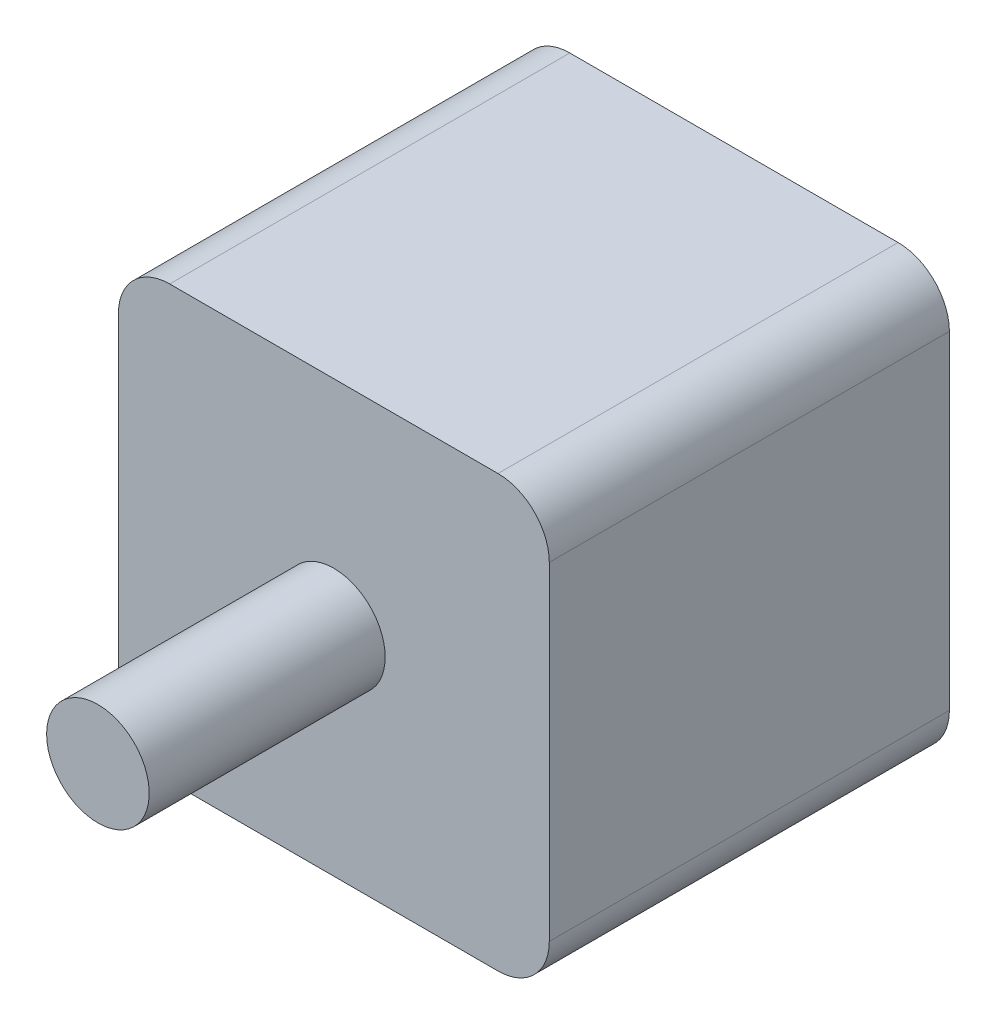
ISO-10303-21;
HEADER;
FILE_DESCRIPTION(('STEP AP214'),'2;1');
FILE_NAME('part.step','',(''),(''),'','','');
FILE_SCHEMA(('AUTOMOTIVE_DESIGN { 1 0 10303 214 1 1 1 1 }'));
ENDSEC;
DATA;
#1=APPLICATION_CONTEXT('core data for automotive mechanical design processes');
#2=APPLICATION_PROTOCOL_DEFINITION('international standard','automotive_design',2000,#1);
#3=PRODUCT_CONTEXT('',#1,'mechanical');
#4=PRODUCT('Part','Part','',(#3));
#5=PRODUCT_RELATED_PRODUCT_CATEGORY('part','',(#4));
#6=PRODUCT_DEFINITION_FORMATION('','',#4);
#7=PRODUCT_DEFINITION_CONTEXT('part definition',#1,'design');
#8=PRODUCT_DEFINITION('design','',#6,#7);
#9=PRODUCT_DEFINITION_SHAPE('','',#8);
#10=(LENGTH_UNIT() NAMED_UNIT(*) SI_UNIT(.MILLI.,.METRE.));
#11=(NAMED_UNIT(*) PLANE_ANGLE_UNIT() SI_UNIT($,.RADIAN.));
#12=(NAMED_UNIT(*) SI_UNIT($,.STERADIAN.) SOLID_ANGLE_UNIT());
#13=UNCERTAINTY_MEASURE_WITH_UNIT(LENGTH_MEASURE(1.E-05),#10,'distance_accuracy_value','');
#14=(GEOMETRIC_REPRESENTATION_CONTEXT(3) GLOBAL_UNCERTAINTY_ASSIGNED_CONTEXT((#13)) GLOBAL_UNIT_ASSIGNED_CONTEXT((#10,
#11,#12)) REPRESENTATION_CONTEXT('',''));
#15=CARTESIAN_POINT('',(0.,0.,0.));
#16=DIRECTION('',(0.,0.,1.));
#17=DIRECTION('',(1.,0.,0.));
#18=AXIS2_PLACEMENT_3D('',#15,#16,#17);
#19=CARTESIAN_POINT('',(0.,0.,0.));
#20=DIRECTION('',(0.,0.,1.));
#21=DIRECTION('',(1.,0.,0.));
#22=AXIS2_PLACEMENT_3D('',#19,#20,#21);
#23=PLANE('',#22);
#24=DIRECTION('',(0.,1.,0.));
#25=VECTOR('',#24,1.);
#26=CARTESIAN_POINT('',(42.,0.,0.));
#27=LINE('',#26,#25);
#28=CARTESIAN_POINT('',(42.,-37.,0.));
#29=VERTEX_POINT('',#28);
#30=CARTESIAN_POINT('',(42.,-5.,0.));
#31=VERTEX_POINT('',#30);
#32=EDGE_CURVE('E117',#29,#31,#27,.T.);
#33=ORIENTED_EDGE('',*,*,#32,.F.);
#34=CARTESIAN_POINT('',(37.,-37.,0.));
#35=DIRECTION('',(0.,0.,1.));
#36=DIRECTION('',(1.,0.,0.));
#37=AXIS2_PLACEMENT_3D('',#34,#35,#36);
#38=CIRCLE('',#37,5.);
#39=CARTESIAN_POINT('',(37.,-42.,0.));
#40=VERTEX_POINT('',#39);
#41=EDGE_CURVE('E100',#29,#40,#38,.F.);
#42=ORIENTED_EDGE('',*,*,#41,.T.);
#43=DIRECTION('',(1.,0.,0.));
#44=VECTOR('',#43,1.);
#45=CARTESIAN_POINT('',(0.,-42.,0.));
#46=LINE('',#45,#44);
#47=CARTESIAN_POINT('',(5.,-42.,0.));
#48=VERTEX_POINT('',#47);
#49=EDGE_CURVE('E125',#48,#40,#46,.T.);
#50=ORIENTED_EDGE('',*,*,#49,.F.);
#51=CARTESIAN_POINT('',(5.,-37.,0.));
#52=DIRECTION('',(0.,0.,1.));
#53=DIRECTION('',(1.,0.,0.));
#54=AXIS2_PLACEMENT_3D('',#51,#52,#53);
#55=CIRCLE('',#54,5.);
#56=CARTESIAN_POINT('',(0.,-37.,0.));
#57=VERTEX_POINT('',#56);
#58=EDGE_CURVE('E111',#48,#57,#55,.F.);
#59=ORIENTED_EDGE('',*,*,#58,.T.);
#60=DIRECTION('',(0.,-1.,0.));
#61=VECTOR('',#60,1.);
#62=CARTESIAN_POINT('',(0.,0.,0.));
#63=LINE('',#62,#61);
#64=CARTESIAN_POINT('',(0.,-5.,0.));
#65=VERTEX_POINT('',#64);
#66=EDGE_CURVE('E129',#65,#57,#63,.T.);
#67=ORIENTED_EDGE('',*,*,#66,.F.);
#68=CARTESIAN_POINT('',(5.,-5.,0.));
#69=DIRECTION('',(0.,0.,1.));
#70=DIRECTION('',(1.,0.,0.));
#71=AXIS2_PLACEMENT_3D('',#68,#69,#70);
#72=CIRCLE('',#71,5.);
#73=CARTESIAN_POINT('',(5.,0.,0.));
#74=VERTEX_POINT('',#73);
#75=EDGE_CURVE('E136',#65,#74,#72,.F.);
#76=ORIENTED_EDGE('',*,*,#75,.T.);
#77=DIRECTION('',(-1.,0.,0.));
#78=VECTOR('',#77,1.);
#79=CARTESIAN_POINT('',(0.,0.,0.));
#80=LINE('',#79,#78);
#81=CARTESIAN_POINT('',(37.,0.,0.));
#82=VERTEX_POINT('',#81);
#83=EDGE_CURVE('E124',#82,#74,#80,.T.);
#84=ORIENTED_EDGE('',*,*,#83,.F.);
#85=CARTESIAN_POINT('',(37.,-5.,0.));
#86=DIRECTION('',(0.,0.,1.));
#87=DIRECTION('',(1.,0.,0.));
#88=AXIS2_PLACEMENT_3D('',#85,#86,#87);
#89=CIRCLE('',#88,5.);
#90=EDGE_CURVE('E120',#82,#31,#89,.F.);
#91=ORIENTED_EDGE('',*,*,#90,.T.);
#92=EDGE_LOOP('',(#33,#42,#50,#59,#67,#76,#84,#91));
#93=FACE_BOUND('',#92,.T.);
#94=ADVANCED_FACE('F33',(#93),#23,.F.);
#95=CARTESIAN_POINT('',(0.,0.,39.));
#96=DIRECTION('',(1.,0.,0.));
#97=DIRECTION('',(0.,1.,0.));
#98=AXIS2_PLACEMENT_3D('',#95,#96,#97);
#99=PLANE('',#98);
#100=ORIENTED_EDGE('',*,*,#66,.T.);
#101=DIRECTION('',(0.,0.,-1.));
#102=VECTOR('',#101,1.);
#103=CARTESIAN_POINT('',(0.,-37.,39.));
#104=LINE('',#103,#102);
#105=CARTESIAN_POINT('',(0.,-37.,39.));
#106=VERTEX_POINT('',#105);
#107=EDGE_CURVE('E152',#57,#106,#104,.F.);
#108=ORIENTED_EDGE('',*,*,#107,.T.);
#109=DIRECTION('',(0.,-1.,0.));
#110=VECTOR('',#109,1.);
#111=CARTESIAN_POINT('',(0.,0.,39.));
#112=LINE('',#111,#110);
#113=CARTESIAN_POINT('',(0.,-5.,39.));
#114=VERTEX_POINT('',#113);
#115=EDGE_CURVE('E127',#114,#106,#112,.T.);
#116=ORIENTED_EDGE('',*,*,#115,.F.);
#117=DIRECTION('',(0.,0.,-1.));
#118=VECTOR('',#117,1.);
#119=CARTESIAN_POINT('',(0.,-5.,39.));
#120=LINE('',#119,#118);
#121=EDGE_CURVE('E149',#114,#65,#120,.T.);
#122=ORIENTED_EDGE('',*,*,#121,.T.);
#123=EDGE_LOOP('',(#100,#108,#116,#122));
#124=FACE_BOUND('',#123,.T.);
#125=ADVANCED_FACE('F166',(#124),#99,.F.);
#126=CARTESIAN_POINT('',(0.,-42.,39.));
#127=DIRECTION('',(0.,1.,0.));
#128=DIRECTION('',(0.,0.,1.));
#129=AXIS2_PLACEMENT_3D('',#126,#127,#128);
#130=PLANE('',#129);
#131=ORIENTED_EDGE('',*,*,#49,.T.);
#132=DIRECTION('',(0.,0.,-1.));
#133=VECTOR('',#132,1.);
#134=CARTESIAN_POINT('',(37.,-42.,39.));
#135=LINE('',#134,#133);
#136=CARTESIAN_POINT('',(37.,-42.,39.));
#137=VERTEX_POINT('',#136);
#138=EDGE_CURVE('E105',#40,#137,#135,.F.);
#139=ORIENTED_EDGE('',*,*,#138,.T.);
#140=DIRECTION('',(1.,0.,0.));
#141=VECTOR('',#140,1.);
#142=CARTESIAN_POINT('',(0.,-42.,39.));
#143=LINE('',#142,#141);
#144=CARTESIAN_POINT('',(5.,-42.,39.));
#145=VERTEX_POINT('',#144);
#146=EDGE_CURVE('E170',#145,#137,#143,.T.);
#147=ORIENTED_EDGE('',*,*,#146,.F.);
#148=DIRECTION('',(0.,0.,-1.));
#149=VECTOR('',#148,1.);
#150=CARTESIAN_POINT('',(5.,-42.,39.));
#151=LINE('',#150,#149);
#152=EDGE_CURVE('E110',#145,#48,#151,.T.);
#153=ORIENTED_EDGE('',*,*,#152,.T.);
#154=EDGE_LOOP('',(#131,#139,#147,#153));
#155=FACE_BOUND('',#154,.T.);
#156=ADVANCED_FACE('F197',(#155),#130,.F.);
#157=CARTESIAN_POINT('',(42.,0.,39.));
#158=DIRECTION('',(-1.,0.,0.));
#159=DIRECTION('',(0.,-1.,0.));
#160=AXIS2_PLACEMENT_3D('',#157,#158,#159);
#161=PLANE('',#160);
#162=DIRECTION('',(0.,1.,0.));
#163=VECTOR('',#162,1.);
#164=CARTESIAN_POINT('',(42.,0.,39.));
#165=LINE('',#164,#163);
#166=CARTESIAN_POINT('',(42.,-37.,39.));
#167=VERTEX_POINT('',#166);
#168=CARTESIAN_POINT('',(42.,-5.,39.));
#169=VERTEX_POINT('',#168);
#170=EDGE_CURVE('E119',#167,#169,#165,.T.);
#171=ORIENTED_EDGE('',*,*,#170,.F.);
#172=DIRECTION('',(0.,0.,-1.));
#173=VECTOR('',#172,1.);
#174=CARTESIAN_POINT('',(42.,-37.,39.));
#175=LINE('',#174,#173);
#176=EDGE_CURVE('E104',#167,#29,#175,.T.);
#177=ORIENTED_EDGE('',*,*,#176,.T.);
#178=ORIENTED_EDGE('',*,*,#32,.T.);
#179=DIRECTION('',(0.,0.,-1.));
#180=VECTOR('',#179,1.);
#181=CARTESIAN_POINT('',(42.,-5.,39.));
#182=LINE('',#181,#180);
#183=EDGE_CURVE('E121',#31,#169,#182,.F.);
#184=ORIENTED_EDGE('',*,*,#183,.T.);
#185=EDGE_LOOP('',(#171,#177,#178,#184));
#186=FACE_BOUND('',#185,.T.);
#187=ADVANCED_FACE('F116',(#186),#161,.F.);
#188=CARTESIAN_POINT('',(0.,0.,39.));
#189=DIRECTION('',(0.,-1.,0.));
#190=DIRECTION('',(0.,0.,-1.));
#191=AXIS2_PLACEMENT_3D('',#188,#189,#190);
#192=PLANE('',#191);
#193=ORIENTED_EDGE('',*,*,#83,.T.);
#194=DIRECTION('',(0.,0.,-1.));
#195=VECTOR('',#194,1.);
#196=CARTESIAN_POINT('',(5.,0.,39.));
#197=LINE('',#196,#195);
#198=CARTESIAN_POINT('',(5.,0.,39.));
#199=VERTEX_POINT('',#198);
#200=EDGE_CURVE('E37',#74,#199,#197,.F.);
#201=ORIENTED_EDGE('',*,*,#200,.T.);
#202=DIRECTION('',(-1.,0.,0.));
#203=VECTOR('',#202,1.);
#204=CARTESIAN_POINT('',(0.,0.,39.));
#205=LINE('',#204,#203);
#206=CARTESIAN_POINT('',(37.,0.,39.));
#207=VERTEX_POINT('',#206);
#208=EDGE_CURVE('E133',#207,#199,#205,.T.);
#209=ORIENTED_EDGE('',*,*,#208,.F.);
#210=DIRECTION('',(0.,0.,-1.));
#211=VECTOR('',#210,1.);
#212=CARTESIAN_POINT('',(37.,0.,39.));
#213=LINE('',#212,#211);
#214=EDGE_CURVE('E153',#207,#82,#213,.T.);
#215=ORIENTED_EDGE('',*,*,#214,.T.);
#216=EDGE_LOOP('',(#193,#201,#209,#215));
#217=FACE_BOUND('',#216,.T.);
#218=ADVANCED_FACE('F156',(#217),#192,.F.);
#219=CARTESIAN_POINT('',(0.,0.,39.));
#220=DIRECTION('',(0.,0.,1.));
#221=DIRECTION('',(1.,0.,0.));
#222=AXIS2_PLACEMENT_3D('',#219,#220,#221);
#223=PLANE('',#222);
#224=CARTESIAN_POINT('',(21.,-21.,39.));
#225=DIRECTION('',(0.,0.,1.));
#226=DIRECTION('',(1.,0.,0.));
#227=AXIS2_PLACEMENT_3D('',#224,#225,#226);
#228=CIRCLE('',#227,5.);
#229=CARTESIAN_POINT('',(26.,-21.,39.));
#230=VERTEX_POINT('',#229);
#231=EDGE_CURVE('E11',#230,#230,#228,.T.);
#232=ORIENTED_EDGE('',*,*,#231,.F.);
#233=EDGE_LOOP('',(#232));
#234=FACE_BOUND('',#233,.T.);
#235=ORIENTED_EDGE('',*,*,#146,.T.);
#236=CARTESIAN_POINT('',(37.,-37.,39.));
#237=DIRECTION('',(0.,0.,1.));
#238=DIRECTION('',(1.,0.,0.));
#239=AXIS2_PLACEMENT_3D('',#236,#237,#238);
#240=CIRCLE('',#239,5.);
#241=EDGE_CURVE('E147',#137,#167,#240,.T.);
#242=ORIENTED_EDGE('',*,*,#241,.T.);
#243=ORIENTED_EDGE('',*,*,#170,.T.);
#244=CARTESIAN_POINT('',(37.,-5.,39.));
#245=DIRECTION('',(0.,0.,1.));
#246=DIRECTION('',(1.,0.,0.));
#247=AXIS2_PLACEMENT_3D('',#244,#245,#246);
#248=CIRCLE('',#247,5.);
#249=EDGE_CURVE('E55',#169,#207,#248,.T.);
#250=ORIENTED_EDGE('',*,*,#249,.T.);
#251=ORIENTED_EDGE('',*,*,#208,.T.);
#252=CARTESIAN_POINT('',(5.,-5.,39.));
#253=DIRECTION('',(0.,0.,1.));
#254=DIRECTION('',(1.,0.,0.));
#255=AXIS2_PLACEMENT_3D('',#252,#253,#254);
#256=CIRCLE('',#255,5.);
#257=EDGE_CURVE('E143',#199,#114,#256,.T.);
#258=ORIENTED_EDGE('',*,*,#257,.T.);
#259=ORIENTED_EDGE('',*,*,#115,.T.);
#260=CARTESIAN_POINT('',(5.,-37.,39.));
#261=DIRECTION('',(0.,0.,1.));
#262=DIRECTION('',(1.,0.,0.));
#263=AXIS2_PLACEMENT_3D('',#260,#261,#262);
#264=CIRCLE('',#263,5.);
#265=EDGE_CURVE('E145',#106,#145,#264,.T.);
#266=ORIENTED_EDGE('',*,*,#265,.T.);
#267=EDGE_LOOP('',(#235,#242,#243,#250,#251,#258,#259,#266));
#268=FACE_BOUND('',#267,.T.);
#269=ADVANCED_FACE('F201',(#234,#268),#223,.T.);
#270=CARTESIAN_POINT('',(37.,-37.,39.));
#271=DIRECTION('',(0.,0.,-1.));
#272=DIRECTION('',(-1.,0.,0.));
#273=AXIS2_PLACEMENT_3D('',#270,#271,#272);
#274=CYLINDRICAL_SURFACE('',#273,5.);
#275=ORIENTED_EDGE('',*,*,#241,.F.);
#276=ORIENTED_EDGE('',*,*,#138,.F.);
#277=ORIENTED_EDGE('',*,*,#41,.F.);
#278=ORIENTED_EDGE('',*,*,#176,.F.);
#279=EDGE_LOOP('',(#275,#276,#277,#278));
#280=FACE_BOUND('',#279,.T.);
#281=ADVANCED_FACE('F103',(#280),#274,.T.);
#282=CARTESIAN_POINT('',(5.,-37.,39.));
#283=DIRECTION('',(0.,0.,-1.));
#284=DIRECTION('',(-1.,0.,0.));
#285=AXIS2_PLACEMENT_3D('',#282,#283,#284);
#286=CYLINDRICAL_SURFACE('',#285,5.);
#287=ORIENTED_EDGE('',*,*,#265,.F.);
#288=ORIENTED_EDGE('',*,*,#107,.F.);
#289=ORIENTED_EDGE('',*,*,#58,.F.);
#290=ORIENTED_EDGE('',*,*,#152,.F.);
#291=EDGE_LOOP('',(#287,#288,#289,#290));
#292=FACE_BOUND('',#291,.T.);
#293=ADVANCED_FACE('F211',(#292),#286,.T.);
#294=CARTESIAN_POINT('',(5.,-5.,39.));
#295=DIRECTION('',(0.,0.,-1.));
#296=DIRECTION('',(-1.,0.,0.));
#297=AXIS2_PLACEMENT_3D('',#294,#295,#296);
#298=CYLINDRICAL_SURFACE('',#297,5.);
#299=ORIENTED_EDGE('',*,*,#257,.F.);
#300=ORIENTED_EDGE('',*,*,#200,.F.);
#301=ORIENTED_EDGE('',*,*,#75,.F.);
#302=ORIENTED_EDGE('',*,*,#121,.F.);
#303=EDGE_LOOP('',(#299,#300,#301,#302));
#304=FACE_BOUND('',#303,.T.);
#305=ADVANCED_FACE('F163',(#304),#298,.T.);
#306=CARTESIAN_POINT('',(37.,-5.,39.));
#307=DIRECTION('',(0.,0.,-1.));
#308=DIRECTION('',(-1.,0.,0.));
#309=AXIS2_PLACEMENT_3D('',#306,#307,#308);
#310=CYLINDRICAL_SURFACE('',#309,5.);
#311=ORIENTED_EDGE('',*,*,#249,.F.);
#312=ORIENTED_EDGE('',*,*,#183,.F.);
#313=ORIENTED_EDGE('',*,*,#90,.F.);
#314=ORIENTED_EDGE('',*,*,#214,.F.);
#315=EDGE_LOOP('',(#311,#312,#313,#314));
#316=FACE_BOUND('',#315,.T.);
#317=ADVANCED_FACE('F35',(#316),#310,.T.);
#318=CARTESIAN_POINT('',(21.,-21.,62.));
#319=DIRECTION('',(0.,0.,-1.));
#320=DIRECTION('',(-1.,0.,0.));
#321=AXIS2_PLACEMENT_3D('',#318,#319,#320);
#322=CYLINDRICAL_SURFACE('',#321,5.);
#323=ORIENTED_EDGE('',*,*,#231,.T.);
#324=EDGE_LOOP('',(#323));
#325=FACE_BOUND('',#324,.T.);
#326=CARTESIAN_POINT('',(21.,-21.,62.));
#327=DIRECTION('',(0.,0.,-1.));
#328=DIRECTION('',(-1.,0.,0.));
#329=AXIS2_PLACEMENT_3D('',#326,#327,#328);
#330=CIRCLE('',#329,5.);
#331=CARTESIAN_POINT('',(16.,-21.,62.));
#332=VERTEX_POINT('',#331);
#333=EDGE_CURVE('E177',#332,#332,#330,.T.);
#334=ORIENTED_EDGE('',*,*,#333,.T.);
#335=EDGE_LOOP('',(#334));
#336=FACE_BOUND('',#335,.T.);
#337=ADVANCED_FACE('F181',(#325,#336),#322,.T.);
#338=CARTESIAN_POINT('',(21.,-21.,62.));
#339=DIRECTION('',(0.,0.,-1.));
#340=DIRECTION('',(-1.,0.,0.));
#341=AXIS2_PLACEMENT_3D('',#338,#339,#340);
#342=PLANE('',#341);
#343=ORIENTED_EDGE('',*,*,#333,.F.);
#344=EDGE_LOOP('',(#343));
#345=FACE_BOUND('',#344,.T.);
#346=ADVANCED_FACE('F183',(#345),#342,.F.);
#347=CLOSED_SHELL('',(#94,#125,#156,#187,#218,#269,#281,#293,#305,#317,#337,#346));
#348=MANIFOLD_SOLID_BREP('B2',#347);
#349=ADVANCED_BREP_SHAPE_REPRESENTATION('',(#18,#348),#14);
#350=SHAPE_DEFINITION_REPRESENTATION(#9,#349);
ENDSEC;
END-ISO-10303-21;
